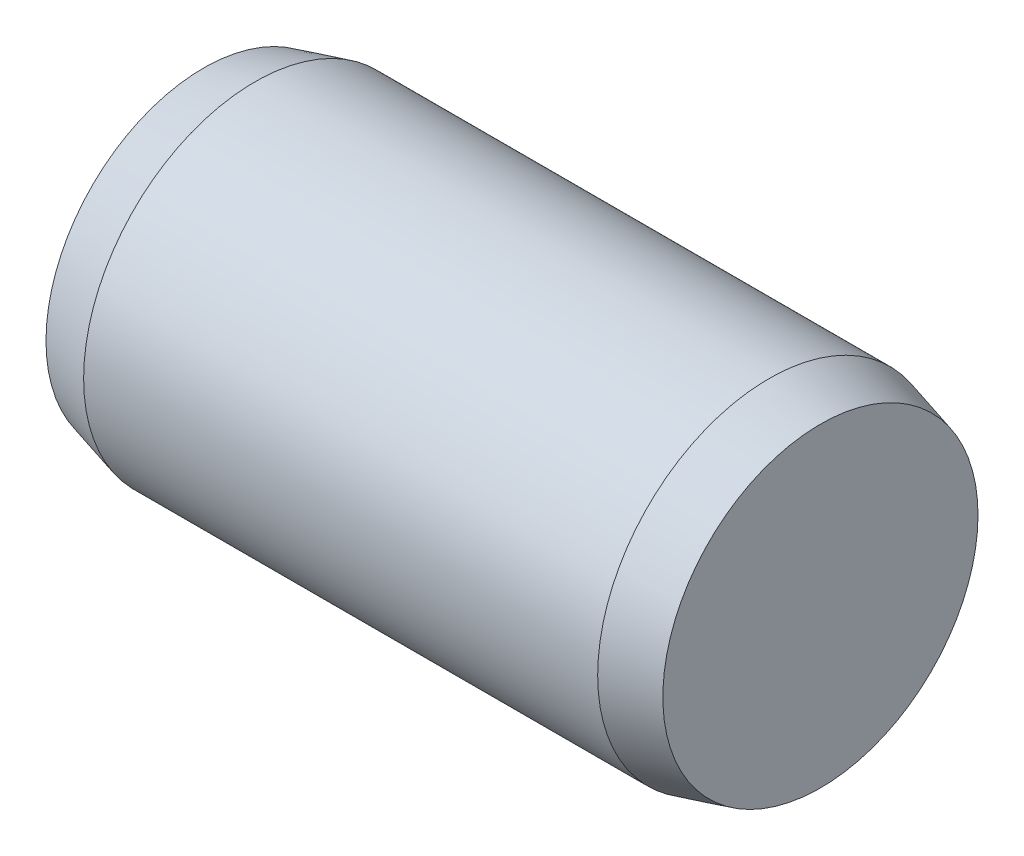
ISO-10303-21;
HEADER;
FILE_DESCRIPTION(('STEP AP214'),'2;1');
FILE_NAME('part.step','',(''),(''),'','','');
FILE_SCHEMA(('AUTOMOTIVE_DESIGN { 1 0 10303 214 1 1 1 1 }'));
ENDSEC;
DATA;
#1=APPLICATION_CONTEXT('core data for automotive mechanical design processes');
#2=APPLICATION_PROTOCOL_DEFINITION('international standard','automotive_design',2000,#1);
#3=PRODUCT_CONTEXT('',#1,'mechanical');
#4=PRODUCT('Part','Part','',(#3));
#5=PRODUCT_RELATED_PRODUCT_CATEGORY('part','',(#4));
#6=PRODUCT_DEFINITION_FORMATION('','',#4);
#7=PRODUCT_DEFINITION_CONTEXT('part definition',#1,'design');
#8=PRODUCT_DEFINITION('design','',#6,#7);
#9=PRODUCT_DEFINITION_SHAPE('','',#8);
#10=(LENGTH_UNIT() NAMED_UNIT(*) SI_UNIT(.MILLI.,.METRE.));
#11=(NAMED_UNIT(*) PLANE_ANGLE_UNIT() SI_UNIT($,.RADIAN.));
#12=(NAMED_UNIT(*) SI_UNIT($,.STERADIAN.) SOLID_ANGLE_UNIT());
#13=UNCERTAINTY_MEASURE_WITH_UNIT(LENGTH_MEASURE(1.E-05),#10,'distance_accuracy_value','');
#14=(GEOMETRIC_REPRESENTATION_CONTEXT(3) GLOBAL_UNCERTAINTY_ASSIGNED_CONTEXT((#13)) GLOBAL_UNIT_ASSIGNED_CONTEXT((#10,
#11,#12)) REPRESENTATION_CONTEXT('',''));
#15=CARTESIAN_POINT('',(0.,0.,0.));
#16=DIRECTION('',(0.,0.,1.));
#17=DIRECTION('',(1.,0.,0.));
#18=AXIS2_PLACEMENT_3D('',#15,#16,#17);
#19=CARTESIAN_POINT('',(-3.,0.,0.));
#20=DIRECTION('',(1.,0.,0.));
#21=DIRECTION('',(0.,0.,-1.));
#22=AXIS2_PLACEMENT_3D('',#19,#20,#21);
#23=CYLINDRICAL_SURFACE('',#22,2.);
#24=CARTESIAN_POINT('',(-3.,0.,0.));
#25=DIRECTION('',(-1.,0.,0.));
#26=DIRECTION('',(0.,0.,1.));
#27=AXIS2_PLACEMENT_3D('',#24,#25,#26);
#28=CIRCLE('',#27,2.);
#29=CARTESIAN_POINT('',(-3.,0.,2.));
#30=VERTEX_POINT('',#29);
#31=EDGE_CURVE('E44',#30,#30,#28,.T.);
#32=ORIENTED_EDGE('',*,*,#31,.F.);
#33=EDGE_LOOP('',(#32));
#34=FACE_BOUND('',#33,.T.);
#35=CARTESIAN_POINT('',(3.,0.,0.));
#36=DIRECTION('',(1.,0.,0.));
#37=DIRECTION('',(0.,0.,-1.));
#38=AXIS2_PLACEMENT_3D('',#35,#36,#37);
#39=CIRCLE('',#38,2.);
#40=CARTESIAN_POINT('',(3.,0.,-2.));
#41=VERTEX_POINT('',#40);
#42=EDGE_CURVE('E10',#41,#41,#39,.T.);
#43=ORIENTED_EDGE('',*,*,#42,.F.);
#44=EDGE_LOOP('',(#43));
#45=FACE_BOUND('',#44,.T.);
#46=ADVANCED_FACE('F30',(#34,#45),#23,.T.);
#47=CARTESIAN_POINT('',(3.,0.,0.));
#48=DIRECTION('',(-1.,0.,0.));
#49=DIRECTION('',(0.,0.,-1.));
#50=AXIS2_PLACEMENT_3D('',#47,#48,#49);
#51=CONICAL_SURFACE('',#50,2.,0.26179938779915);
#52=CARTESIAN_POINT('',(3.6,0.,0.));
#53=DIRECTION('',(1.,0.,0.));
#54=DIRECTION('',(0.,0.,-1.));
#55=AXIS2_PLACEMENT_3D('',#52,#53,#54);
#56=CIRCLE('',#55,1.83923048454133);
#57=CARTESIAN_POINT('',(3.6,0.,-1.83923048454133));
#58=VERTEX_POINT('',#57);
#59=EDGE_CURVE('E36',#58,#58,#56,.T.);
#60=ORIENTED_EDGE('',*,*,#59,.F.);
#61=EDGE_LOOP('',(#60));
#62=FACE_BOUND('',#61,.T.);
#63=ORIENTED_EDGE('',*,*,#42,.T.);
#64=EDGE_LOOP('',(#63));
#65=FACE_BOUND('',#64,.T.);
#66=ADVANCED_FACE('F54',(#62,#65),#51,.T.);
#67=CARTESIAN_POINT('',(3.6,0.,0.));
#68=DIRECTION('',(1.,0.,0.));
#69=DIRECTION('',(0.,0.,-1.));
#70=AXIS2_PLACEMENT_3D('',#67,#68,#69);
#71=PLANE('',#70);
#72=ORIENTED_EDGE('',*,*,#59,.T.);
#73=EDGE_LOOP('',(#72));
#74=FACE_BOUND('',#73,.T.);
#75=ADVANCED_FACE('F58',(#74),#71,.T.);
#76=CARTESIAN_POINT('',(-3.,0.,0.));
#77=DIRECTION('',(1.,0.,0.));
#78=DIRECTION('',(0.,0.,1.));
#79=AXIS2_PLACEMENT_3D('',#76,#77,#78);
#80=CONICAL_SURFACE('',#79,2.,0.26179938779915);
#81=CARTESIAN_POINT('',(-3.6,0.,0.));
#82=DIRECTION('',(-1.,0.,0.));
#83=DIRECTION('',(0.,0.,1.));
#84=AXIS2_PLACEMENT_3D('',#81,#82,#83);
#85=CIRCLE('',#84,1.83923048454133);
#86=CARTESIAN_POINT('',(-3.6,0.,1.83923048454133));
#87=VERTEX_POINT('',#86);
#88=EDGE_CURVE('E40',#87,#87,#85,.T.);
#89=ORIENTED_EDGE('',*,*,#88,.F.);
#90=EDGE_LOOP('',(#89));
#91=FACE_BOUND('',#90,.T.);
#92=ORIENTED_EDGE('',*,*,#31,.T.);
#93=EDGE_LOOP('',(#92));
#94=FACE_BOUND('',#93,.T.);
#95=ADVANCED_FACE('F50',(#91,#94),#80,.T.);
#96=CARTESIAN_POINT('',(-3.6,0.,0.));
#97=DIRECTION('',(-1.,0.,0.));
#98=DIRECTION('',(0.,0.,1.));
#99=AXIS2_PLACEMENT_3D('',#96,#97,#98);
#100=PLANE('',#99);
#101=ORIENTED_EDGE('',*,*,#88,.T.);
#102=EDGE_LOOP('',(#101));
#103=FACE_BOUND('',#102,.T.);
#104=ADVANCED_FACE('F67',(#103),#100,.T.);
#105=CLOSED_SHELL('',(#46,#66,#75,#95,#104));
#106=MANIFOLD_SOLID_BREP('B2',#105);
#107=ADVANCED_BREP_SHAPE_REPRESENTATION('',(#18,#106),#14);
#108=SHAPE_DEFINITION_REPRESENTATION(#9,#107);
ENDSEC;
END-ISO-10303-21;
